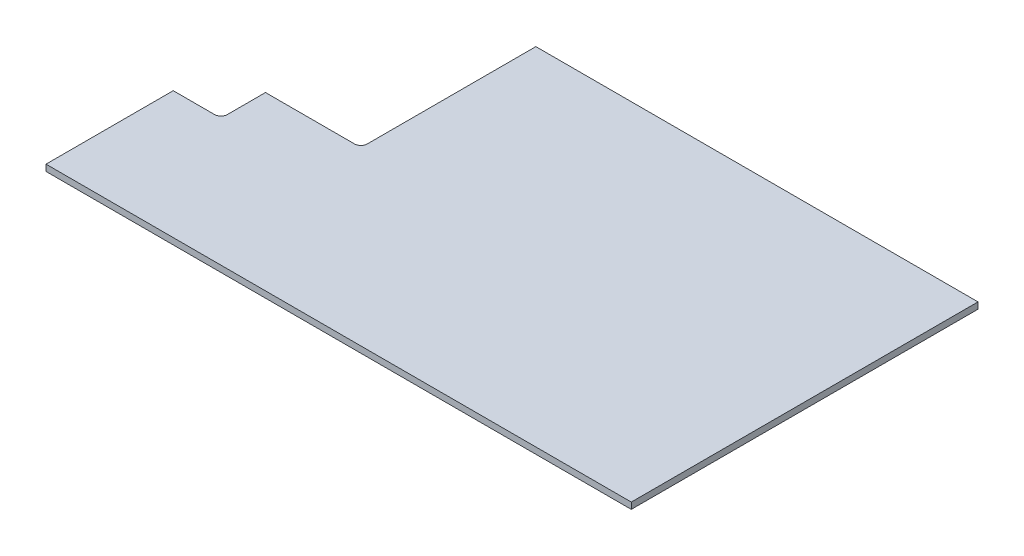
ISO-10303-21;
HEADER;
FILE_DESCRIPTION(('STEP AP214'),'2;1');
FILE_NAME('part.step','',(''),(''),'','','');
FILE_SCHEMA(('AUTOMOTIVE_DESIGN { 1 0 10303 214 1 1 1 1 }'));
ENDSEC;
DATA;
#1=APPLICATION_CONTEXT('core data for automotive mechanical design processes');
#2=APPLICATION_PROTOCOL_DEFINITION('international standard','automotive_design',2000,#1);
#3=PRODUCT_CONTEXT('',#1,'mechanical');
#4=PRODUCT('Part','Part','',(#3));
#5=PRODUCT_RELATED_PRODUCT_CATEGORY('part','',(#4));
#6=PRODUCT_DEFINITION_FORMATION('','',#4);
#7=PRODUCT_DEFINITION_CONTEXT('part definition',#1,'design');
#8=PRODUCT_DEFINITION('design','',#6,#7);
#9=PRODUCT_DEFINITION_SHAPE('','',#8);
#10=(LENGTH_UNIT() NAMED_UNIT(*) SI_UNIT(.MILLI.,.METRE.));
#11=(NAMED_UNIT(*) PLANE_ANGLE_UNIT() SI_UNIT($,.RADIAN.));
#12=(NAMED_UNIT(*) SI_UNIT($,.STERADIAN.) SOLID_ANGLE_UNIT());
#13=UNCERTAINTY_MEASURE_WITH_UNIT(LENGTH_MEASURE(1.E-05),#10,'distance_accuracy_value','');
#14=(GEOMETRIC_REPRESENTATION_CONTEXT(3) GLOBAL_UNCERTAINTY_ASSIGNED_CONTEXT((#13)) GLOBAL_UNIT_ASSIGNED_CONTEXT((#10,
#11,#12)) REPRESENTATION_CONTEXT('',''));
#15=CARTESIAN_POINT('',(0.,0.,0.));
#16=DIRECTION('',(0.,0.,1.));
#17=DIRECTION('',(1.,0.,0.));
#18=AXIS2_PLACEMENT_3D('',#15,#16,#17);
#19=CARTESIAN_POINT('',(-15.,1.,0.));
#20=DIRECTION('',(0.,0.,1.));
#21=DIRECTION('',(1.,0.,0.));
#22=AXIS2_PLACEMENT_3D('',#19,#20,#21);
#23=PLANE('',#22);
#24=DIRECTION('',(-1.,0.,0.));
#25=VECTOR('',#24,1.);
#26=CARTESIAN_POINT('',(-15.,1.,0.));
#27=LINE('',#26,#25);
#28=CARTESIAN_POINT('',(-1.,1.,0.));
#29=VERTEX_POINT('',#28);
#30=CARTESIAN_POINT('',(-15.,1.,0.));
#31=VERTEX_POINT('',#30);
#32=EDGE_CURVE('E111',#29,#31,#27,.T.);
#33=ORIENTED_EDGE('',*,*,#32,.F.);
#34=DIRECTION('',(0.,-1.,0.));
#35=VECTOR('',#34,1.);
#36=CARTESIAN_POINT('',(-1.,0.,0.));
#37=LINE('',#36,#35);
#38=CARTESIAN_POINT('',(-1.,0.,0.));
#39=VERTEX_POINT('',#38);
#40=EDGE_CURVE('E145',#29,#39,#37,.T.);
#41=ORIENTED_EDGE('',*,*,#40,.T.);
#42=DIRECTION('',(-1.,0.,0.));
#43=VECTOR('',#42,1.);
#44=CARTESIAN_POINT('',(-15.,0.,0.));
#45=LINE('',#44,#43);
#46=CARTESIAN_POINT('',(-15.,0.,0.));
#47=VERTEX_POINT('',#46);
#48=EDGE_CURVE('E132',#39,#47,#45,.T.);
#49=ORIENTED_EDGE('',*,*,#48,.T.);
#50=DIRECTION('',(0.,-1.,0.));
#51=VECTOR('',#50,1.);
#52=CARTESIAN_POINT('',(-15.,1.,0.));
#53=LINE('',#52,#51);
#54=EDGE_CURVE('E127',#31,#47,#53,.T.);
#55=ORIENTED_EDGE('',*,*,#54,.F.);
#56=EDGE_LOOP('',(#33,#41,#49,#55));
#57=FACE_BOUND('',#56,.T.);
#58=ADVANCED_FACE('F34',(#57),#23,.F.);
#59=CARTESIAN_POINT('',(-15.,1.,7.));
#60=DIRECTION('',(1.,0.,0.));
#61=DIRECTION('',(0.,0.,-1.));
#62=AXIS2_PLACEMENT_3D('',#59,#60,#61);
#63=PLANE('',#62);
#64=DIRECTION('',(0.,0.,1.));
#65=VECTOR('',#64,1.);
#66=CARTESIAN_POINT('',(-15.,0.,7.));
#67=LINE('',#66,#65);
#68=CARTESIAN_POINT('',(-15.,0.,6.));
#69=VERTEX_POINT('',#68);
#70=EDGE_CURVE('E163',#47,#69,#67,.T.);
#71=ORIENTED_EDGE('',*,*,#70,.T.);
#72=DIRECTION('',(0.,-1.,0.));
#73=VECTOR('',#72,1.);
#74=CARTESIAN_POINT('',(-15.,1.,6.));
#75=LINE('',#74,#73);
#76=CARTESIAN_POINT('',(-15.,1.,6.));
#77=VERTEX_POINT('',#76);
#78=EDGE_CURVE('E129',#69,#77,#75,.F.);
#79=ORIENTED_EDGE('',*,*,#78,.T.);
#80=DIRECTION('',(0.,0.,1.));
#81=VECTOR('',#80,1.);
#82=CARTESIAN_POINT('',(-15.,1.,7.));
#83=LINE('',#82,#81);
#84=EDGE_CURVE('E114',#31,#77,#83,.T.);
#85=ORIENTED_EDGE('',*,*,#84,.F.);
#86=ORIENTED_EDGE('',*,*,#54,.T.);
#87=EDGE_LOOP('',(#71,#79,#85,#86));
#88=FACE_BOUND('',#87,.T.);
#89=ADVANCED_FACE('F126',(#88),#63,.F.);
#90=CARTESIAN_POINT('',(-22.5,1.,7.));
#91=DIRECTION('',(0.,0.,1.));
#92=DIRECTION('',(1.,0.,0.));
#93=AXIS2_PLACEMENT_3D('',#90,#91,#92);
#94=PLANE('',#93);
#95=DIRECTION('',(-1.,0.,0.));
#96=VECTOR('',#95,1.);
#97=CARTESIAN_POINT('',(-22.5,1.,7.));
#98=LINE('',#97,#96);
#99=CARTESIAN_POINT('',(-16.,1.,7.));
#100=VERTEX_POINT('',#99);
#101=CARTESIAN_POINT('',(-22.5,1.,7.));
#102=VERTEX_POINT('',#101);
#103=EDGE_CURVE('E130',#100,#102,#98,.T.);
#104=ORIENTED_EDGE('',*,*,#103,.F.);
#105=DIRECTION('',(0.,-1.,0.));
#106=VECTOR('',#105,1.);
#107=CARTESIAN_POINT('',(-16.,0.,7.));
#108=LINE('',#107,#106);
#109=CARTESIAN_POINT('',(-16.,0.,7.));
#110=VERTEX_POINT('',#109);
#111=EDGE_CURVE('E134',#100,#110,#108,.T.);
#112=ORIENTED_EDGE('',*,*,#111,.T.);
#113=DIRECTION('',(-1.,0.,0.));
#114=VECTOR('',#113,1.);
#115=CARTESIAN_POINT('',(-22.5,0.,7.));
#116=LINE('',#115,#114);
#117=CARTESIAN_POINT('',(-22.5,0.,7.));
#118=VERTEX_POINT('',#117);
#119=EDGE_CURVE('E165',#110,#118,#116,.T.);
#120=ORIENTED_EDGE('',*,*,#119,.T.);
#121=DIRECTION('',(0.,-1.,0.));
#122=VECTOR('',#121,1.);
#123=CARTESIAN_POINT('',(-22.5,1.,7.));
#124=LINE('',#123,#122);
#125=EDGE_CURVE('E135',#102,#118,#124,.T.);
#126=ORIENTED_EDGE('',*,*,#125,.F.);
#127=EDGE_LOOP('',(#104,#112,#120,#126));
#128=FACE_BOUND('',#127,.T.);
#129=ADVANCED_FACE('F156',(#128),#94,.F.);
#130=CARTESIAN_POINT('',(-22.5,1.,27.));
#131=DIRECTION('',(1.,0.,0.));
#132=DIRECTION('',(0.,0.,-1.));
#133=AXIS2_PLACEMENT_3D('',#130,#131,#132);
#134=PLANE('',#133);
#135=DIRECTION('',(0.,0.,1.));
#136=VECTOR('',#135,1.);
#137=CARTESIAN_POINT('',(-22.5,0.,27.));
#138=LINE('',#137,#136);
#139=CARTESIAN_POINT('',(-22.5,0.,27.));
#140=VERTEX_POINT('',#139);
#141=EDGE_CURVE('E167',#118,#140,#138,.T.);
#142=ORIENTED_EDGE('',*,*,#141,.T.);
#143=DIRECTION('',(0.,-1.,0.));
#144=VECTOR('',#143,1.);
#145=CARTESIAN_POINT('',(-22.5,1.,27.));
#146=LINE('',#145,#144);
#147=CARTESIAN_POINT('',(-22.5,1.,27.));
#148=VERTEX_POINT('',#147);
#149=EDGE_CURVE('E140',#148,#140,#146,.T.);
#150=ORIENTED_EDGE('',*,*,#149,.F.);
#151=DIRECTION('',(0.,0.,1.));
#152=VECTOR('',#151,1.);
#153=CARTESIAN_POINT('',(-22.5,1.,27.));
#154=LINE('',#153,#152);
#155=EDGE_CURVE('E159',#102,#148,#154,.T.);
#156=ORIENTED_EDGE('',*,*,#155,.F.);
#157=ORIENTED_EDGE('',*,*,#125,.T.);
#158=EDGE_LOOP('',(#142,#150,#156,#157));
#159=FACE_BOUND('',#158,.T.);
#160=ADVANCED_FACE('F214',(#159),#134,.F.);
#161=CARTESIAN_POINT('',(69.5,1.,27.));
#162=DIRECTION('',(0.,0.,-1.));
#163=DIRECTION('',(-1.,0.,0.));
#164=AXIS2_PLACEMENT_3D('',#161,#162,#163);
#165=PLANE('',#164);
#166=DIRECTION('',(1.,0.,0.));
#167=VECTOR('',#166,1.);
#168=CARTESIAN_POINT('',(69.5,0.,27.));
#169=LINE('',#168,#167);
#170=CARTESIAN_POINT('',(69.5,0.,27.));
#171=VERTEX_POINT('',#170);
#172=EDGE_CURVE('E173',#140,#171,#169,.T.);
#173=ORIENTED_EDGE('',*,*,#172,.T.);
#174=DIRECTION('',(0.,-1.,0.));
#175=VECTOR('',#174,1.);
#176=CARTESIAN_POINT('',(69.5,1.,27.));
#177=LINE('',#176,#175);
#178=CARTESIAN_POINT('',(69.5,1.,27.));
#179=VERTEX_POINT('',#178);
#180=EDGE_CURVE('E187',#179,#171,#177,.T.);
#181=ORIENTED_EDGE('',*,*,#180,.F.);
#182=DIRECTION('',(1.,0.,0.));
#183=VECTOR('',#182,1.);
#184=CARTESIAN_POINT('',(69.5,1.,27.));
#185=LINE('',#184,#183);
#186=EDGE_CURVE('E196',#148,#179,#185,.T.);
#187=ORIENTED_EDGE('',*,*,#186,.F.);
#188=ORIENTED_EDGE('',*,*,#149,.T.);
#189=EDGE_LOOP('',(#173,#181,#187,#188));
#190=FACE_BOUND('',#189,.T.);
#191=ADVANCED_FACE('F194',(#190),#165,.F.);
#192=CARTESIAN_POINT('',(69.5,1.,-27.5));
#193=DIRECTION('',(-1.,0.,0.));
#194=DIRECTION('',(0.,0.,1.));
#195=AXIS2_PLACEMENT_3D('',#192,#193,#194);
#196=PLANE('',#195);
#197=DIRECTION('',(0.,0.,-1.));
#198=VECTOR('',#197,1.);
#199=CARTESIAN_POINT('',(69.5,0.,-27.5));
#200=LINE('',#199,#198);
#201=CARTESIAN_POINT('',(69.5,0.,-27.5));
#202=VERTEX_POINT('',#201);
#203=EDGE_CURVE('E175',#171,#202,#200,.T.);
#204=ORIENTED_EDGE('',*,*,#203,.T.);
#205=DIRECTION('',(0.,-1.,0.));
#206=VECTOR('',#205,1.);
#207=CARTESIAN_POINT('',(69.5,1.,-27.5));
#208=LINE('',#207,#206);
#209=CARTESIAN_POINT('',(69.5,1.,-27.5));
#210=VERTEX_POINT('',#209);
#211=EDGE_CURVE('E183',#210,#202,#208,.T.);
#212=ORIENTED_EDGE('',*,*,#211,.F.);
#213=DIRECTION('',(0.,0.,-1.));
#214=VECTOR('',#213,1.);
#215=CARTESIAN_POINT('',(69.5,1.,-27.5));
#216=LINE('',#215,#214);
#217=EDGE_CURVE('E209',#179,#210,#216,.T.);
#218=ORIENTED_EDGE('',*,*,#217,.F.);
#219=ORIENTED_EDGE('',*,*,#180,.T.);
#220=EDGE_LOOP('',(#204,#212,#218,#219));
#221=FACE_BOUND('',#220,.T.);
#222=ADVANCED_FACE('F202',(#221),#196,.F.);
#223=CARTESIAN_POINT('',(0.,1.,-27.5));
#224=DIRECTION('',(0.,0.,1.));
#225=DIRECTION('',(1.,0.,0.));
#226=AXIS2_PLACEMENT_3D('',#223,#224,#225);
#227=PLANE('',#226);
#228=DIRECTION('',(-1.,0.,0.));
#229=VECTOR('',#228,1.);
#230=CARTESIAN_POINT('',(0.,0.,-27.5));
#231=LINE('',#230,#229);
#232=CARTESIAN_POINT('',(0.,0.,-27.5));
#233=VERTEX_POINT('',#232);
#234=EDGE_CURVE('E177',#202,#233,#231,.T.);
#235=ORIENTED_EDGE('',*,*,#234,.T.);
#236=DIRECTION('',(0.,-1.,0.));
#237=VECTOR('',#236,1.);
#238=CARTESIAN_POINT('',(0.,1.,-27.5));
#239=LINE('',#238,#237);
#240=CARTESIAN_POINT('',(0.,1.,-27.5));
#241=VERTEX_POINT('',#240);
#242=EDGE_CURVE('E180',#241,#233,#239,.T.);
#243=ORIENTED_EDGE('',*,*,#242,.F.);
#244=DIRECTION('',(-1.,0.,0.));
#245=VECTOR('',#244,1.);
#246=CARTESIAN_POINT('',(0.,1.,-27.5));
#247=LINE('',#246,#245);
#248=EDGE_CURVE('E208',#210,#241,#247,.T.);
#249=ORIENTED_EDGE('',*,*,#248,.F.);
#250=ORIENTED_EDGE('',*,*,#211,.T.);
#251=EDGE_LOOP('',(#235,#243,#249,#250));
#252=FACE_BOUND('',#251,.T.);
#253=ADVANCED_FACE('F206',(#252),#227,.F.);
#254=CARTESIAN_POINT('',(0.,1.,0.));
#255=DIRECTION('',(1.,0.,0.));
#256=DIRECTION('',(0.,0.,-1.));
#257=AXIS2_PLACEMENT_3D('',#254,#255,#256);
#258=PLANE('',#257);
#259=DIRECTION('',(0.,0.,1.));
#260=VECTOR('',#259,1.);
#261=CARTESIAN_POINT('',(0.,0.,0.));
#262=LINE('',#261,#260);
#263=CARTESIAN_POINT('',(0.,0.,-1.));
#264=VERTEX_POINT('',#263);
#265=EDGE_CURVE('E121',#233,#264,#262,.T.);
#266=ORIENTED_EDGE('',*,*,#265,.T.);
#267=DIRECTION('',(0.,-1.,0.));
#268=VECTOR('',#267,1.);
#269=CARTESIAN_POINT('',(0.,1.,-1.));
#270=LINE('',#269,#268);
#271=CARTESIAN_POINT('',(0.,1.,-1.));
#272=VERTEX_POINT('',#271);
#273=EDGE_CURVE('E49',#264,#272,#270,.F.);
#274=ORIENTED_EDGE('',*,*,#273,.T.);
#275=DIRECTION('',(0.,0.,1.));
#276=VECTOR('',#275,1.);
#277=CARTESIAN_POINT('',(0.,1.,0.));
#278=LINE('',#277,#276);
#279=EDGE_CURVE('E184',#241,#272,#278,.T.);
#280=ORIENTED_EDGE('',*,*,#279,.F.);
#281=ORIENTED_EDGE('',*,*,#242,.T.);
#282=EDGE_LOOP('',(#266,#274,#280,#281));
#283=FACE_BOUND('',#282,.T.);
#284=ADVANCED_FACE('F239',(#283),#258,.F.);
#285=CARTESIAN_POINT('',(0.,1.,0.));
#286=DIRECTION('',(0.,1.,0.));
#287=DIRECTION('',(0.,0.,1.));
#288=AXIS2_PLACEMENT_3D('',#285,#286,#287);
#289=PLANE('',#288);
#290=ORIENTED_EDGE('',*,*,#279,.T.);
#291=CARTESIAN_POINT('',(-1.,1.,-1.));
#292=DIRECTION('',(0.,1.,0.));
#293=DIRECTION('',(0.,0.,1.));
#294=AXIS2_PLACEMENT_3D('',#291,#292,#293);
#295=CIRCLE('',#294,1.);
#296=EDGE_CURVE('E11',#272,#29,#295,.F.);
#297=ORIENTED_EDGE('',*,*,#296,.T.);
#298=ORIENTED_EDGE('',*,*,#32,.T.);
#299=ORIENTED_EDGE('',*,*,#84,.T.);
#300=CARTESIAN_POINT('',(-16.,1.,6.));
#301=DIRECTION('',(0.,1.,0.));
#302=DIRECTION('',(0.,0.,1.));
#303=AXIS2_PLACEMENT_3D('',#300,#301,#302);
#304=CIRCLE('',#303,1.);
#305=EDGE_CURVE('E150',#77,#100,#304,.F.);
#306=ORIENTED_EDGE('',*,*,#305,.T.);
#307=ORIENTED_EDGE('',*,*,#103,.T.);
#308=ORIENTED_EDGE('',*,*,#155,.T.);
#309=ORIENTED_EDGE('',*,*,#186,.T.);
#310=ORIENTED_EDGE('',*,*,#217,.T.);
#311=ORIENTED_EDGE('',*,*,#248,.T.);
#312=EDGE_LOOP('',(#290,#297,#298,#299,#306,#307,#308,#309,#310,#311));
#313=FACE_BOUND('',#312,.T.);
#314=ADVANCED_FACE('F113',(#313),#289,.T.);
#315=CARTESIAN_POINT('',(0.,0.,0.));
#316=DIRECTION('',(0.,1.,0.));
#317=DIRECTION('',(0.,0.,1.));
#318=AXIS2_PLACEMENT_3D('',#315,#316,#317);
#319=PLANE('',#318);
#320=ORIENTED_EDGE('',*,*,#48,.F.);
#321=CARTESIAN_POINT('',(-1.,0.,-1.));
#322=DIRECTION('',(0.,1.,0.));
#323=DIRECTION('',(0.,0.,1.));
#324=AXIS2_PLACEMENT_3D('',#321,#322,#323);
#325=CIRCLE('',#324,1.);
#326=EDGE_CURVE('E42',#39,#264,#325,.T.);
#327=ORIENTED_EDGE('',*,*,#326,.T.);
#328=ORIENTED_EDGE('',*,*,#265,.F.);
#329=ORIENTED_EDGE('',*,*,#234,.F.);
#330=ORIENTED_EDGE('',*,*,#203,.F.);
#331=ORIENTED_EDGE('',*,*,#172,.F.);
#332=ORIENTED_EDGE('',*,*,#141,.F.);
#333=ORIENTED_EDGE('',*,*,#119,.F.);
#334=CARTESIAN_POINT('',(-16.,0.,6.));
#335=DIRECTION('',(0.,1.,0.));
#336=DIRECTION('',(0.,0.,1.));
#337=AXIS2_PLACEMENT_3D('',#334,#335,#336);
#338=CIRCLE('',#337,1.);
#339=EDGE_CURVE('E148',#110,#69,#338,.T.);
#340=ORIENTED_EDGE('',*,*,#339,.T.);
#341=ORIENTED_EDGE('',*,*,#70,.F.);
#342=EDGE_LOOP('',(#320,#327,#328,#329,#330,#331,#332,#333,#340,#341));
#343=FACE_BOUND('',#342,.T.);
#344=ADVANCED_FACE('F162',(#343),#319,.F.);
#345=CARTESIAN_POINT('',(-16.,1.,6.));
#346=DIRECTION('',(0.,1.,0.));
#347=DIRECTION('',(0.,0.,1.));
#348=AXIS2_PLACEMENT_3D('',#345,#346,#347);
#349=CYLINDRICAL_SURFACE('',#348,1.);
#350=ORIENTED_EDGE('',*,*,#305,.F.);
#351=ORIENTED_EDGE('',*,*,#78,.F.);
#352=ORIENTED_EDGE('',*,*,#339,.F.);
#353=ORIENTED_EDGE('',*,*,#111,.F.);
#354=EDGE_LOOP('',(#350,#351,#352,#353));
#355=FACE_BOUND('',#354,.T.);
#356=ADVANCED_FACE('F161',(#355),#349,.F.);
#357=CARTESIAN_POINT('',(-1.,1.,-1.));
#358=DIRECTION('',(0.,1.,0.));
#359=DIRECTION('',(0.,0.,1.));
#360=AXIS2_PLACEMENT_3D('',#357,#358,#359);
#361=CYLINDRICAL_SURFACE('',#360,1.);
#362=ORIENTED_EDGE('',*,*,#296,.F.);
#363=ORIENTED_EDGE('',*,*,#273,.F.);
#364=ORIENTED_EDGE('',*,*,#326,.F.);
#365=ORIENTED_EDGE('',*,*,#40,.F.);
#366=EDGE_LOOP('',(#362,#363,#364,#365));
#367=FACE_BOUND('',#366,.T.);
#368=ADVANCED_FACE('F36',(#367),#361,.F.);
#369=CLOSED_SHELL('',(#58,#89,#129,#160,#191,#222,#253,#284,#314,#344,#356,#368));
#370=MANIFOLD_SOLID_BREP('B2',#369);
#371=ADVANCED_BREP_SHAPE_REPRESENTATION('',(#18,#370),#14);
#372=SHAPE_DEFINITION_REPRESENTATION(#9,#371);
ENDSEC;
END-ISO-10303-21;
